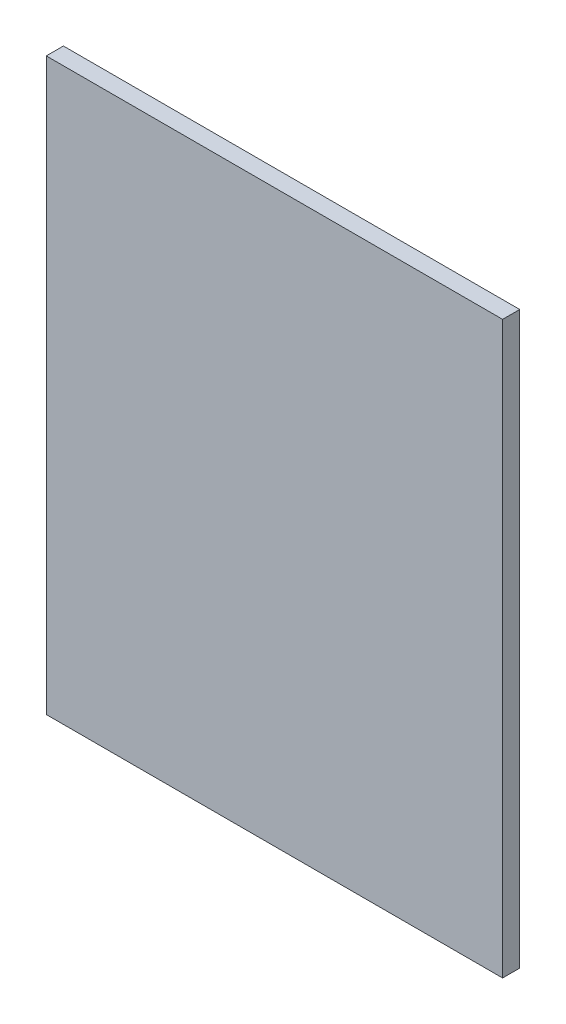
ISO-10303-21;
HEADER;
FILE_DESCRIPTION(('STEP AP214'),'2;1');
FILE_NAME('part.step','',(''),(''),'','','');
FILE_SCHEMA(('AUTOMOTIVE_DESIGN { 1 0 10303 214 1 1 1 1 }'));
ENDSEC;
DATA;
#1=APPLICATION_CONTEXT('core data for automotive mechanical design processes');
#2=APPLICATION_PROTOCOL_DEFINITION('international standard','automotive_design',2000,#1);
#3=PRODUCT_CONTEXT('',#1,'mechanical');
#4=PRODUCT('Part','Part','',(#3));
#5=PRODUCT_RELATED_PRODUCT_CATEGORY('part','',(#4));
#6=PRODUCT_DEFINITION_FORMATION('','',#4);
#7=PRODUCT_DEFINITION_CONTEXT('part definition',#1,'design');
#8=PRODUCT_DEFINITION('design','',#6,#7);
#9=PRODUCT_DEFINITION_SHAPE('','',#8);
#10=(LENGTH_UNIT() NAMED_UNIT(*) SI_UNIT(.MILLI.,.METRE.));
#11=(NAMED_UNIT(*) PLANE_ANGLE_UNIT() SI_UNIT($,.RADIAN.));
#12=(NAMED_UNIT(*) SI_UNIT($,.STERADIAN.) SOLID_ANGLE_UNIT());
#13=UNCERTAINTY_MEASURE_WITH_UNIT(LENGTH_MEASURE(1.E-05),#10,'distance_accuracy_value','');
#14=(GEOMETRIC_REPRESENTATION_CONTEXT(3) GLOBAL_UNCERTAINTY_ASSIGNED_CONTEXT((#13)) GLOBAL_UNIT_ASSIGNED_CONTEXT((#10,
#11,#12)) REPRESENTATION_CONTEXT('',''));
#15=CARTESIAN_POINT('',(0.,0.,0.));
#16=DIRECTION('',(0.,0.,1.));
#17=DIRECTION('',(1.,0.,0.));
#18=AXIS2_PLACEMENT_3D('',#15,#16,#17);
#19=CARTESIAN_POINT('',(-24.4395604395604,11.1208791208791,3.));
#20=DIRECTION('',(1.,0.,0.));
#21=DIRECTION('',(0.,1.,0.));
#22=AXIS2_PLACEMENT_3D('',#19,#20,#21);
#23=PLANE('',#22);
#24=DIRECTION('',(0.,-1.,0.));
#25=VECTOR('',#24,1.);
#26=CARTESIAN_POINT('',(-24.4395604395604,11.1208791208791,0.));
#27=LINE('',#26,#25);
#28=CARTESIAN_POINT('',(-24.4395604395604,11.1208791208791,0.));
#29=VERTEX_POINT('',#28);
#30=CARTESIAN_POINT('',(-24.4395604395604,-88.8791208791209,0.));
#31=VERTEX_POINT('',#30);
#32=EDGE_CURVE('E96',#29,#31,#27,.T.);
#33=ORIENTED_EDGE('',*,*,#32,.T.);
#34=DIRECTION('',(0.,0.,-1.));
#35=VECTOR('',#34,1.);
#36=CARTESIAN_POINT('',(-24.4395604395604,-88.8791208791209,3.));
#37=LINE('',#36,#35);
#38=CARTESIAN_POINT('',(-24.4395604395604,-88.8791208791209,3.));
#39=VERTEX_POINT('',#38);
#40=EDGE_CURVE('E11',#39,#31,#37,.T.);
#41=ORIENTED_EDGE('',*,*,#40,.F.);
#42=DIRECTION('',(0.,-1.,0.));
#43=VECTOR('',#42,1.);
#44=CARTESIAN_POINT('',(-24.4395604395604,11.1208791208791,3.));
#45=LINE('',#44,#43);
#46=CARTESIAN_POINT('',(-24.4395604395604,11.1208791208791,3.));
#47=VERTEX_POINT('',#46);
#48=EDGE_CURVE('E84',#47,#39,#45,.T.);
#49=ORIENTED_EDGE('',*,*,#48,.F.);
#50=DIRECTION('',(0.,0.,-1.));
#51=VECTOR('',#50,1.);
#52=CARTESIAN_POINT('',(-24.4395604395604,11.1208791208791,3.));
#53=LINE('',#52,#51);
#54=EDGE_CURVE('E92',#47,#29,#53,.T.);
#55=ORIENTED_EDGE('',*,*,#54,.T.);
#56=EDGE_LOOP('',(#33,#41,#49,#55));
#57=FACE_BOUND('',#56,.T.);
#58=ADVANCED_FACE('F33',(#57),#23,.F.);
#59=CARTESIAN_POINT('',(-24.4395604395604,-88.8791208791209,3.));
#60=DIRECTION('',(0.,1.,0.));
#61=DIRECTION('',(0.,0.,1.));
#62=AXIS2_PLACEMENT_3D('',#59,#60,#61);
#63=PLANE('',#62);
#64=DIRECTION('',(1.,0.,0.));
#65=VECTOR('',#64,1.);
#66=CARTESIAN_POINT('',(-24.4395604395604,-88.8791208791209,0.));
#67=LINE('',#66,#65);
#68=CARTESIAN_POINT('',(55.5604395604396,-88.8791208791209,0.));
#69=VERTEX_POINT('',#68);
#70=EDGE_CURVE('E88',#31,#69,#67,.T.);
#71=ORIENTED_EDGE('',*,*,#70,.T.);
#72=DIRECTION('',(0.,0.,-1.));
#73=VECTOR('',#72,1.);
#74=CARTESIAN_POINT('',(55.5604395604396,-88.8791208791209,3.));
#75=LINE('',#74,#73);
#76=CARTESIAN_POINT('',(55.5604395604396,-88.8791208791209,3.));
#77=VERTEX_POINT('',#76);
#78=EDGE_CURVE('E41',#77,#69,#75,.T.);
#79=ORIENTED_EDGE('',*,*,#78,.F.);
#80=DIRECTION('',(1.,0.,0.));
#81=VECTOR('',#80,1.);
#82=CARTESIAN_POINT('',(-24.4395604395604,-88.8791208791209,3.));
#83=LINE('',#82,#81);
#84=EDGE_CURVE('E79',#39,#77,#83,.T.);
#85=ORIENTED_EDGE('',*,*,#84,.F.);
#86=ORIENTED_EDGE('',*,*,#40,.T.);
#87=EDGE_LOOP('',(#71,#79,#85,#86));
#88=FACE_BOUND('',#87,.T.);
#89=ADVANCED_FACE('F87',(#88),#63,.F.);
#90=CARTESIAN_POINT('',(55.5604395604396,11.1208791208791,3.));
#91=DIRECTION('',(-1.,0.,0.));
#92=DIRECTION('',(0.,-1.,0.));
#93=AXIS2_PLACEMENT_3D('',#90,#91,#92);
#94=PLANE('',#93);
#95=DIRECTION('',(0.,1.,0.));
#96=VECTOR('',#95,1.);
#97=CARTESIAN_POINT('',(55.5604395604396,11.1208791208791,0.));
#98=LINE('',#97,#96);
#99=CARTESIAN_POINT('',(55.5604395604396,11.1208791208791,0.));
#100=VERTEX_POINT('',#99);
#101=EDGE_CURVE('E66',#69,#100,#98,.T.);
#102=ORIENTED_EDGE('',*,*,#101,.T.);
#103=DIRECTION('',(0.,0.,-1.));
#104=VECTOR('',#103,1.);
#105=CARTESIAN_POINT('',(55.5604395604396,11.1208791208791,3.));
#106=LINE('',#105,#104);
#107=CARTESIAN_POINT('',(55.5604395604396,11.1208791208791,3.));
#108=VERTEX_POINT('',#107);
#109=EDGE_CURVE('E89',#108,#100,#106,.T.);
#110=ORIENTED_EDGE('',*,*,#109,.F.);
#111=DIRECTION('',(0.,1.,0.));
#112=VECTOR('',#111,1.);
#113=CARTESIAN_POINT('',(55.5604395604396,11.1208791208791,3.));
#114=LINE('',#113,#112);
#115=EDGE_CURVE('E82',#77,#108,#114,.T.);
#116=ORIENTED_EDGE('',*,*,#115,.F.);
#117=ORIENTED_EDGE('',*,*,#78,.T.);
#118=EDGE_LOOP('',(#102,#110,#116,#117));
#119=FACE_BOUND('',#118,.T.);
#120=ADVANCED_FACE('F90',(#119),#94,.F.);
#121=CARTESIAN_POINT('',(-24.4395604395604,11.1208791208791,3.));
#122=DIRECTION('',(0.,-1.,0.));
#123=DIRECTION('',(0.,0.,-1.));
#124=AXIS2_PLACEMENT_3D('',#121,#122,#123);
#125=PLANE('',#124);
#126=DIRECTION('',(-1.,0.,0.));
#127=VECTOR('',#126,1.);
#128=CARTESIAN_POINT('',(-24.4395604395604,11.1208791208791,0.));
#129=LINE('',#128,#127);
#130=EDGE_CURVE('E72',#100,#29,#129,.T.);
#131=ORIENTED_EDGE('',*,*,#130,.T.);
#132=ORIENTED_EDGE('',*,*,#54,.F.);
#133=DIRECTION('',(-1.,0.,0.));
#134=VECTOR('',#133,1.);
#135=CARTESIAN_POINT('',(-24.4395604395604,11.1208791208791,3.));
#136=LINE('',#135,#134);
#137=EDGE_CURVE('E49',#108,#47,#136,.T.);
#138=ORIENTED_EDGE('',*,*,#137,.F.);
#139=ORIENTED_EDGE('',*,*,#109,.T.);
#140=EDGE_LOOP('',(#131,#132,#138,#139));
#141=FACE_BOUND('',#140,.T.);
#142=ADVANCED_FACE('F103',(#141),#125,.F.);
#143=CARTESIAN_POINT('',(0.,0.,3.));
#144=DIRECTION('',(0.,0.,1.));
#145=DIRECTION('',(1.,0.,0.));
#146=AXIS2_PLACEMENT_3D('',#143,#144,#145);
#147=PLANE('',#146);
#148=ORIENTED_EDGE('',*,*,#48,.T.);
#149=ORIENTED_EDGE('',*,*,#84,.T.);
#150=ORIENTED_EDGE('',*,*,#115,.T.);
#151=ORIENTED_EDGE('',*,*,#137,.T.);
#152=EDGE_LOOP('',(#148,#149,#150,#151));
#153=FACE_BOUND('',#152,.T.);
#154=ADVANCED_FACE('F80',(#153),#147,.T.);
#155=CARTESIAN_POINT('',(0.,0.,0.));
#156=DIRECTION('',(0.,0.,1.));
#157=DIRECTION('',(1.,0.,0.));
#158=AXIS2_PLACEMENT_3D('',#155,#156,#157);
#159=PLANE('',#158);
#160=ORIENTED_EDGE('',*,*,#32,.F.);
#161=ORIENTED_EDGE('',*,*,#130,.F.);
#162=ORIENTED_EDGE('',*,*,#101,.F.);
#163=ORIENTED_EDGE('',*,*,#70,.F.);
#164=EDGE_LOOP('',(#160,#161,#162,#163));
#165=FACE_BOUND('',#164,.T.);
#166=ADVANCED_FACE('F106',(#165),#159,.F.);
#167=CLOSED_SHELL('',(#58,#89,#120,#142,#154,#166));
#168=MANIFOLD_SOLID_BREP('B2',#167);
#169=ADVANCED_BREP_SHAPE_REPRESENTATION('',(#18,#168),#14);
#170=SHAPE_DEFINITION_REPRESENTATION(#9,#169);
ENDSEC;
END-ISO-10303-21;
